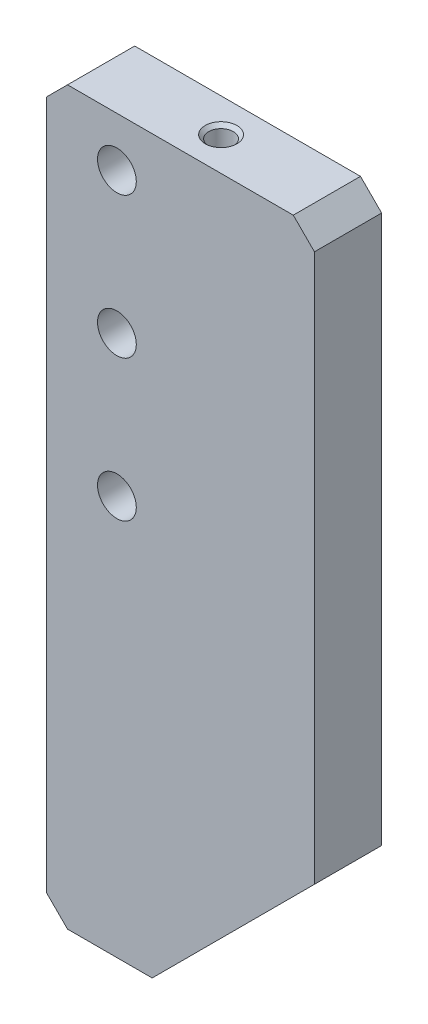
ISO-10303-21;
HEADER;
FILE_DESCRIPTION(('STEP AP214'),'2;1');
FILE_NAME('part.step','',(''),(''),'','','');
FILE_SCHEMA(('AUTOMOTIVE_DESIGN { 1 0 10303 214 1 1 1 1 }'));
ENDSEC;
DATA;
#1=APPLICATION_CONTEXT('core data for automotive mechanical design processes');
#2=APPLICATION_PROTOCOL_DEFINITION('international standard','automotive_design',2000,#1);
#3=PRODUCT_CONTEXT('',#1,'mechanical');
#4=PRODUCT('Part','Part','',(#3));
#5=PRODUCT_RELATED_PRODUCT_CATEGORY('part','',(#4));
#6=PRODUCT_DEFINITION_FORMATION('','',#4);
#7=PRODUCT_DEFINITION_CONTEXT('part definition',#1,'design');
#8=PRODUCT_DEFINITION('design','',#6,#7);
#9=PRODUCT_DEFINITION_SHAPE('','',#8);
#10=(LENGTH_UNIT() NAMED_UNIT(*) SI_UNIT(.MILLI.,.METRE.));
#11=(NAMED_UNIT(*) PLANE_ANGLE_UNIT() SI_UNIT($,.RADIAN.));
#12=(NAMED_UNIT(*) SI_UNIT($,.STERADIAN.) SOLID_ANGLE_UNIT());
#13=UNCERTAINTY_MEASURE_WITH_UNIT(LENGTH_MEASURE(1.E-05),#10,'distance_accuracy_value','');
#14=(GEOMETRIC_REPRESENTATION_CONTEXT(3) GLOBAL_UNCERTAINTY_ASSIGNED_CONTEXT((#13)) GLOBAL_UNIT_ASSIGNED_CONTEXT((#10,
#11,#12)) REPRESENTATION_CONTEXT('',''));
#15=CARTESIAN_POINT('',(0.,0.,0.));
#16=DIRECTION('',(0.,0.,1.));
#17=DIRECTION('',(1.,0.,0.));
#18=AXIS2_PLACEMENT_3D('',#15,#16,#17);
#19=CARTESIAN_POINT('',(-147.247691321001,32.5523086789982,-4.7625));
#20=DIRECTION('',(0.707106781186572,-0.707106781186523,0.));
#21=DIRECTION('',(0.707106781186523,0.707106781186572,0.));
#22=AXIS2_PLACEMENT_3D('',#19,#20,#21);
#23=PLANE('',#22);
#24=DIRECTION('',(0.,0.,1.));
#25=VECTOR('',#24,1.);
#26=CARTESIAN_POINT('',(-147.247691321001,32.5523086789982,-4.7625));
#27=LINE('',#26,#25);
#28=CARTESIAN_POINT('',(-147.247691321001,32.5523086789982,-4.7625));
#29=VERTEX_POINT('',#28);
#30=CARTESIAN_POINT('',(-147.247691321001,32.5523086789982,4.7625));
#31=VERTEX_POINT('',#30);
#32=EDGE_CURVE('E161',#29,#31,#27,.T.);
#33=ORIENTED_EDGE('',*,*,#32,.T.);
#34=DIRECTION('',(0.707106781186523,0.707106781186572,0.));
#35=VECTOR('',#34,1.);
#36=CARTESIAN_POINT('',(-147.247691321001,32.5523086789982,4.7625));
#37=LINE('',#36,#35);
#38=CARTESIAN_POINT('',(-170.247691321001,9.55230867899661,4.7625));
#39=VERTEX_POINT('',#38);
#40=EDGE_CURVE('E125',#39,#31,#37,.T.);
#41=ORIENTED_EDGE('',*,*,#40,.F.);
#42=DIRECTION('',(0.,0.,1.));
#43=VECTOR('',#42,1.);
#44=CARTESIAN_POINT('',(-170.247691321001,9.55230867899661,-4.7625));
#45=LINE('',#44,#43);
#46=CARTESIAN_POINT('',(-170.247691321001,9.55230867899661,-4.7625));
#47=VERTEX_POINT('',#46);
#48=EDGE_CURVE('E162',#47,#39,#45,.T.);
#49=ORIENTED_EDGE('',*,*,#48,.F.);
#50=DIRECTION('',(0.707106781186523,0.707106781186572,0.));
#51=VECTOR('',#50,1.);
#52=CARTESIAN_POINT('',(-147.247691321001,32.5523086789982,-4.7625));
#53=LINE('',#52,#51);
#54=EDGE_CURVE('E148',#47,#29,#53,.T.);
#55=ORIENTED_EDGE('',*,*,#54,.T.);
#56=EDGE_LOOP('',(#33,#41,#49,#55));
#57=FACE_BOUND('',#56,.T.);
#58=ADVANCED_FACE('F31',(#57),#23,.T.);
#59=CARTESIAN_POINT('',(-170.247691321001,9.55230867899661,-4.7625));
#60=DIRECTION('',(0.,-1.,0.));
#61=DIRECTION('',(1.,0.,0.));
#62=AXIS2_PLACEMENT_3D('',#59,#60,#61);
#63=PLANE('',#62);
#64=DIRECTION('',(1.,0.,0.));
#65=VECTOR('',#64,1.);
#66=CARTESIAN_POINT('',(-170.247691321001,9.55230867899661,4.7625));
#67=LINE('',#66,#65);
#68=CARTESIAN_POINT('',(-182.247691321001,9.55230867899657,4.7625));
#69=VERTEX_POINT('',#68);
#70=EDGE_CURVE('E137',#69,#39,#67,.T.);
#71=ORIENTED_EDGE('',*,*,#70,.F.);
#72=DIRECTION('',(0.,0.,-1.));
#73=VECTOR('',#72,1.);
#74=CARTESIAN_POINT('',(-182.247691321001,9.55230867899657,-4.7625));
#75=LINE('',#74,#73);
#76=CARTESIAN_POINT('',(-182.247691321001,9.55230867899657,-4.7625));
#77=VERTEX_POINT('',#76);
#78=EDGE_CURVE('E189',#69,#77,#75,.T.);
#79=ORIENTED_EDGE('',*,*,#78,.T.);
#80=DIRECTION('',(1.,0.,0.));
#81=VECTOR('',#80,1.);
#82=CARTESIAN_POINT('',(-170.247691321001,9.55230867899661,-4.7625));
#83=LINE('',#82,#81);
#84=EDGE_CURVE('E159',#77,#47,#83,.T.);
#85=ORIENTED_EDGE('',*,*,#84,.T.);
#86=ORIENTED_EDGE('',*,*,#48,.T.);
#87=EDGE_LOOP('',(#71,#79,#85,#86));
#88=FACE_BOUND('',#87,.T.);
#89=ADVANCED_FACE('F206',(#88),#63,.T.);
#90=CARTESIAN_POINT('',(-185.247691321001,113.192388155427,-4.7625));
#91=DIRECTION('',(-1.,0.,0.));
#92=DIRECTION('',(0.,-1.,0.));
#93=AXIS2_PLACEMENT_3D('',#90,#91,#92);
#94=PLANE('',#93);
#95=DIRECTION('',(0.,-1.,0.));
#96=VECTOR('',#95,1.);
#97=CARTESIAN_POINT('',(-185.247691321001,113.192388155427,-4.7625));
#98=LINE('',#97,#96);
#99=CARTESIAN_POINT('',(-185.247691321001,110.192388155427,-4.7625));
#100=VERTEX_POINT('',#99);
#101=CARTESIAN_POINT('',(-185.247691321001,12.5523086789966,-4.7625));
#102=VERTEX_POINT('',#101);
#103=EDGE_CURVE('E157',#100,#102,#98,.T.);
#104=ORIENTED_EDGE('',*,*,#103,.T.);
#105=DIRECTION('',(0.,0.,1.));
#106=VECTOR('',#105,1.);
#107=CARTESIAN_POINT('',(-185.247691321001,12.5523086789966,-4.7625));
#108=LINE('',#107,#106);
#109=CARTESIAN_POINT('',(-185.247691321001,12.5523086789966,4.7625));
#110=VERTEX_POINT('',#109);
#111=EDGE_CURVE('E186',#102,#110,#108,.T.);
#112=ORIENTED_EDGE('',*,*,#111,.T.);
#113=DIRECTION('',(0.,-1.,0.));
#114=VECTOR('',#113,1.);
#115=CARTESIAN_POINT('',(-185.247691321001,113.192388155427,4.7625));
#116=LINE('',#115,#114);
#117=CARTESIAN_POINT('',(-185.247691321001,110.192388155427,4.7625));
#118=VERTEX_POINT('',#117);
#119=EDGE_CURVE('E134',#118,#110,#116,.T.);
#120=ORIENTED_EDGE('',*,*,#119,.F.);
#121=DIRECTION('',(0.,0.,-1.));
#122=VECTOR('',#121,1.);
#123=CARTESIAN_POINT('',(-185.247691321001,110.192388155427,-4.7625));
#124=LINE('',#123,#122);
#125=EDGE_CURVE('E53',#118,#100,#124,.T.);
#126=ORIENTED_EDGE('',*,*,#125,.T.);
#127=EDGE_LOOP('',(#104,#112,#120,#126));
#128=FACE_BOUND('',#127,.T.);
#129=ADVANCED_FACE('F212',(#128),#94,.T.);
#130=CARTESIAN_POINT('',(-185.247691321001,113.192388155427,-4.7625));
#131=DIRECTION('',(0.,1.,0.));
#132=DIRECTION('',(-1.,0.,0.));
#133=AXIS2_PLACEMENT_3D('',#130,#131,#132);
#134=PLANE('',#133);
#135=CARTESIAN_POINT('',(-165.247691321001,113.192388155427,0.));
#136=DIRECTION('',(0.,1.,0.));
#137=DIRECTION('',(-1.,0.,0.));
#138=AXIS2_PLACEMENT_3D('',#135,#136,#137);
#139=CIRCLE('',#138,2.25);
#140=CARTESIAN_POINT('',(-167.497691321001,113.192388155427,0.));
#141=VERTEX_POINT('',#140);
#142=EDGE_CURVE('E11',#141,#141,#139,.F.);
#143=ORIENTED_EDGE('',*,*,#142,.T.);
#144=EDGE_LOOP('',(#143));
#145=FACE_BOUND('',#144,.T.);
#146=DIRECTION('',(-1.,0.,0.));
#147=VECTOR('',#146,1.);
#148=CARTESIAN_POINT('',(-185.247691321001,113.192388155427,4.7625));
#149=LINE('',#148,#147);
#150=CARTESIAN_POINT('',(-150.247691321001,113.192388155427,4.7625));
#151=VERTEX_POINT('',#150);
#152=CARTESIAN_POINT('',(-182.247691321001,113.192388155427,4.7625));
#153=VERTEX_POINT('',#152);
#154=EDGE_CURVE('E131',#151,#153,#149,.T.);
#155=ORIENTED_EDGE('',*,*,#154,.F.);
#156=DIRECTION('',(0.,0.,-1.));
#157=VECTOR('',#156,1.);
#158=CARTESIAN_POINT('',(-150.247691321001,113.192388155427,-4.7625));
#159=LINE('',#158,#157);
#160=CARTESIAN_POINT('',(-150.247691321001,113.192388155427,-4.7625));
#161=VERTEX_POINT('',#160);
#162=EDGE_CURVE('E178',#151,#161,#159,.T.);
#163=ORIENTED_EDGE('',*,*,#162,.T.);
#164=DIRECTION('',(-1.,0.,0.));
#165=VECTOR('',#164,1.);
#166=CARTESIAN_POINT('',(-185.247691321001,113.192388155427,-4.7625));
#167=LINE('',#166,#165);
#168=CARTESIAN_POINT('',(-182.247691321001,113.192388155427,-4.7625));
#169=VERTEX_POINT('',#168);
#170=EDGE_CURVE('E154',#161,#169,#167,.T.);
#171=ORIENTED_EDGE('',*,*,#170,.T.);
#172=DIRECTION('',(0.,0.,1.));
#173=VECTOR('',#172,1.);
#174=CARTESIAN_POINT('',(-182.247691321001,113.192388155427,-4.7625));
#175=LINE('',#174,#173);
#176=EDGE_CURVE('E175',#169,#153,#175,.T.);
#177=ORIENTED_EDGE('',*,*,#176,.T.);
#178=EDGE_LOOP('',(#155,#163,#171,#177));
#179=FACE_BOUND('',#178,.T.);
#180=ADVANCED_FACE('F236',(#145,#179),#134,.T.);
#181=CARTESIAN_POINT('',(-147.247691321001,113.192388155427,-4.7625));
#182=DIRECTION('',(1.,0.,0.));
#183=DIRECTION('',(0.,1.,0.));
#184=AXIS2_PLACEMENT_3D('',#181,#182,#183);
#185=PLANE('',#184);
#186=DIRECTION('',(0.,1.,0.));
#187=VECTOR('',#186,1.);
#188=CARTESIAN_POINT('',(-147.247691321001,113.192388155427,-4.7625));
#189=LINE('',#188,#187);
#190=CARTESIAN_POINT('',(-147.247691321001,110.192388155427,-4.7625));
#191=VERTEX_POINT('',#190);
#192=EDGE_CURVE('E151',#29,#191,#189,.T.);
#193=ORIENTED_EDGE('',*,*,#192,.T.);
#194=DIRECTION('',(0.,0.,1.));
#195=VECTOR('',#194,1.);
#196=CARTESIAN_POINT('',(-147.247691321001,110.192388155427,-4.7625));
#197=LINE('',#196,#195);
#198=CARTESIAN_POINT('',(-147.247691321001,110.192388155427,4.7625));
#199=VERTEX_POINT('',#198);
#200=EDGE_CURVE('E165',#191,#199,#197,.T.);
#201=ORIENTED_EDGE('',*,*,#200,.T.);
#202=DIRECTION('',(0.,1.,0.));
#203=VECTOR('',#202,1.);
#204=CARTESIAN_POINT('',(-147.247691321001,113.192388155427,4.7625));
#205=LINE('',#204,#203);
#206=EDGE_CURVE('E128',#31,#199,#205,.T.);
#207=ORIENTED_EDGE('',*,*,#206,.F.);
#208=ORIENTED_EDGE('',*,*,#32,.F.);
#209=EDGE_LOOP('',(#193,#201,#207,#208));
#210=FACE_BOUND('',#209,.T.);
#211=ADVANCED_FACE('F217',(#210),#185,.T.);
#212=CARTESIAN_POINT('',(-170.247691321001,9.55230867899661,-4.7625));
#213=DIRECTION('',(0.,0.,-1.));
#214=DIRECTION('',(-1.,0.,0.));
#215=AXIS2_PLACEMENT_3D('',#212,#213,#214);
#216=PLANE('',#215);
#217=CARTESIAN_POINT('',(-175.247691321001,106.192388155427,-4.7625));
#218=DIRECTION('',(0.,0.,1.));
#219=DIRECTION('',(1.,0.,0.));
#220=AXIS2_PLACEMENT_3D('',#217,#218,#219);
#221=CIRCLE('',#220,2.75000000000001);
#222=CARTESIAN_POINT('',(-172.497691321001,106.192388155427,-4.7625));
#223=VERTEX_POINT('',#222);
#224=EDGE_CURVE('E139',#223,#223,#221,.T.);
#225=ORIENTED_EDGE('',*,*,#224,.T.);
#226=EDGE_LOOP('',(#225));
#227=FACE_BOUND('',#226,.T.);
#228=CARTESIAN_POINT('',(-175.247691321001,86.1923881554272,-4.7625));
#229=DIRECTION('',(0.,0.,1.));
#230=DIRECTION('',(1.,0.,0.));
#231=AXIS2_PLACEMENT_3D('',#228,#229,#230);
#232=CIRCLE('',#231,2.75000000000001);
#233=CARTESIAN_POINT('',(-172.497691321001,86.1923881554272,-4.7625));
#234=VERTEX_POINT('',#233);
#235=EDGE_CURVE('E142',#234,#234,#232,.T.);
#236=ORIENTED_EDGE('',*,*,#235,.T.);
#237=EDGE_LOOP('',(#236));
#238=FACE_BOUND('',#237,.T.);
#239=CARTESIAN_POINT('',(-175.247691321001,66.1923881554272,-4.7625));
#240=DIRECTION('',(0.,0.,1.));
#241=DIRECTION('',(1.,0.,0.));
#242=AXIS2_PLACEMENT_3D('',#239,#240,#241);
#243=CIRCLE('',#242,2.75000000000001);
#244=CARTESIAN_POINT('',(-172.497691321001,66.1923881554272,-4.7625));
#245=VERTEX_POINT('',#244);
#246=EDGE_CURVE('E145',#245,#245,#243,.T.);
#247=ORIENTED_EDGE('',*,*,#246,.T.);
#248=EDGE_LOOP('',(#247));
#249=FACE_BOUND('',#248,.T.);
#250=ORIENTED_EDGE('',*,*,#170,.F.);
#251=DIRECTION('',(-0.707106781186551,0.707106781186544,0.));
#252=VECTOR('',#251,1.);
#253=CARTESIAN_POINT('',(-108.427651582786,71.3723484172124,-4.7625));
#254=LINE('',#253,#252);
#255=EDGE_CURVE('E183',#161,#191,#254,.F.);
#256=ORIENTED_EDGE('',*,*,#255,.T.);
#257=ORIENTED_EDGE('',*,*,#192,.F.);
#258=ORIENTED_EDGE('',*,*,#54,.F.);
#259=ORIENTED_EDGE('',*,*,#84,.F.);
#260=DIRECTION('',(0.707106781186551,-0.707106781186544,0.));
#261=VECTOR('',#260,1.);
#262=CARTESIAN_POINT('',(-176.247691321001,3.5523086789966,-4.7625));
#263=LINE('',#262,#261);
#264=EDGE_CURVE('E46',#77,#102,#263,.F.);
#265=ORIENTED_EDGE('',*,*,#264,.T.);
#266=ORIENTED_EDGE('',*,*,#103,.F.);
#267=DIRECTION('',(-0.707106781186549,-0.707106781186546,0.));
#268=VECTOR('',#267,1.);
#269=CARTESIAN_POINT('',(-228.067731059216,67.3723484172121,-4.7625));
#270=LINE('',#269,#268);
#271=EDGE_CURVE('E180',#100,#169,#270,.F.);
#272=ORIENTED_EDGE('',*,*,#271,.T.);
#273=EDGE_LOOP('',(#250,#256,#257,#258,#259,#265,#266,#272));
#274=FACE_BOUND('',#273,.T.);
#275=ADVANCED_FACE('F240',(#227,#238,#249,#274),#216,.T.);
#276=CARTESIAN_POINT('',(-175.247691321001,66.1923881554272,-4.7625));
#277=DIRECTION('',(0.,0.,1.));
#278=DIRECTION('',(1.,0.,0.));
#279=AXIS2_PLACEMENT_3D('',#276,#277,#278);
#280=CYLINDRICAL_SURFACE('',#279,2.75000000000001);
#281=ORIENTED_EDGE('',*,*,#246,.F.);
#282=EDGE_LOOP('',(#281));
#283=FACE_BOUND('',#282,.T.);
#284=CARTESIAN_POINT('',(-175.247691321001,66.1923881554272,4.7625));
#285=DIRECTION('',(0.,0.,1.));
#286=DIRECTION('',(1.,0.,0.));
#287=AXIS2_PLACEMENT_3D('',#284,#285,#286);
#288=CIRCLE('',#287,2.75000000000001);
#289=CARTESIAN_POINT('',(-172.497691321001,66.1923881554272,4.7625));
#290=VERTEX_POINT('',#289);
#291=EDGE_CURVE('E122',#290,#290,#288,.T.);
#292=ORIENTED_EDGE('',*,*,#291,.T.);
#293=EDGE_LOOP('',(#292));
#294=FACE_BOUND('',#293,.T.);
#295=ADVANCED_FACE('F253',(#283,#294),#280,.F.);
#296=CARTESIAN_POINT('',(-175.247691321001,86.1923881554272,-4.7625));
#297=DIRECTION('',(0.,0.,1.));
#298=DIRECTION('',(1.,0.,0.));
#299=AXIS2_PLACEMENT_3D('',#296,#297,#298);
#300=CYLINDRICAL_SURFACE('',#299,2.75000000000001);
#301=ORIENTED_EDGE('',*,*,#235,.F.);
#302=EDGE_LOOP('',(#301));
#303=FACE_BOUND('',#302,.T.);
#304=CARTESIAN_POINT('',(-175.247691321001,86.1923881554272,4.7625));
#305=DIRECTION('',(0.,0.,1.));
#306=DIRECTION('',(1.,0.,0.));
#307=AXIS2_PLACEMENT_3D('',#304,#305,#306);
#308=CIRCLE('',#307,2.75000000000001);
#309=CARTESIAN_POINT('',(-172.497691321001,86.1923881554272,4.7625));
#310=VERTEX_POINT('',#309);
#311=EDGE_CURVE('E113',#310,#310,#308,.T.);
#312=ORIENTED_EDGE('',*,*,#311,.T.);
#313=EDGE_LOOP('',(#312));
#314=FACE_BOUND('',#313,.T.);
#315=ADVANCED_FACE('F264',(#303,#314),#300,.F.);
#316=CARTESIAN_POINT('',(-175.247691321001,106.192388155427,-4.7625));
#317=DIRECTION('',(0.,0.,1.));
#318=DIRECTION('',(1.,0.,0.));
#319=AXIS2_PLACEMENT_3D('',#316,#317,#318);
#320=CYLINDRICAL_SURFACE('',#319,2.75000000000001);
#321=ORIENTED_EDGE('',*,*,#224,.F.);
#322=EDGE_LOOP('',(#321));
#323=FACE_BOUND('',#322,.T.);
#324=CARTESIAN_POINT('',(-175.247691321001,106.192388155427,4.7625));
#325=DIRECTION('',(0.,0.,1.));
#326=DIRECTION('',(1.,0.,0.));
#327=AXIS2_PLACEMENT_3D('',#324,#325,#326);
#328=CIRCLE('',#327,2.75000000000001);
#329=CARTESIAN_POINT('',(-172.497691321001,106.192388155427,4.7625));
#330=VERTEX_POINT('',#329);
#331=EDGE_CURVE('E109',#330,#330,#328,.T.);
#332=ORIENTED_EDGE('',*,*,#331,.T.);
#333=EDGE_LOOP('',(#332));
#334=FACE_BOUND('',#333,.T.);
#335=ADVANCED_FACE('F268',(#323,#334),#320,.F.);
#336=CARTESIAN_POINT('',(-170.247691321001,9.55230867899661,4.7625));
#337=DIRECTION('',(0.,0.,-1.));
#338=DIRECTION('',(-1.,0.,0.));
#339=AXIS2_PLACEMENT_3D('',#336,#337,#338);
#340=PLANE('',#339);
#341=ORIENTED_EDGE('',*,*,#311,.F.);
#342=EDGE_LOOP('',(#341));
#343=FACE_BOUND('',#342,.T.);
#344=ORIENTED_EDGE('',*,*,#206,.T.);
#345=DIRECTION('',(0.707106781186551,-0.707106781186544,0.));
#346=VECTOR('',#345,1.);
#347=CARTESIAN_POINT('',(-147.247691321001,110.192388155427,4.7625));
#348=LINE('',#347,#346);
#349=EDGE_CURVE('E173',#199,#151,#348,.F.);
#350=ORIENTED_EDGE('',*,*,#349,.T.);
#351=ORIENTED_EDGE('',*,*,#154,.T.);
#352=DIRECTION('',(0.707106781186549,0.707106781186546,0.));
#353=VECTOR('',#352,1.);
#354=CARTESIAN_POINT('',(-182.247691321001,113.192388155427,4.7625));
#355=LINE('',#354,#353);
#356=EDGE_CURVE('E169',#153,#118,#355,.F.);
#357=ORIENTED_EDGE('',*,*,#356,.T.);
#358=ORIENTED_EDGE('',*,*,#119,.T.);
#359=DIRECTION('',(-0.707106781186551,0.707106781186544,0.));
#360=VECTOR('',#359,1.);
#361=CARTESIAN_POINT('',(-185.247691321001,12.5523086789966,4.7625));
#362=LINE('',#361,#360);
#363=EDGE_CURVE('E171',#110,#69,#362,.F.);
#364=ORIENTED_EDGE('',*,*,#363,.T.);
#365=ORIENTED_EDGE('',*,*,#70,.T.);
#366=ORIENTED_EDGE('',*,*,#40,.T.);
#367=EDGE_LOOP('',(#344,#350,#351,#357,#358,#364,#365,#366));
#368=FACE_BOUND('',#367,.T.);
#369=ORIENTED_EDGE('',*,*,#291,.F.);
#370=EDGE_LOOP('',(#369));
#371=FACE_BOUND('',#370,.T.);
#372=ORIENTED_EDGE('',*,*,#331,.F.);
#373=EDGE_LOOP('',(#372));
#374=FACE_BOUND('',#373,.T.);
#375=ADVANCED_FACE('F103',(#343,#368,#371,#374),#340,.F.);
#376=CARTESIAN_POINT('',(-165.247691321001,93.0191830746703,0.));
#377=DIRECTION('',(0.,1.,0.));
#378=DIRECTION('',(-1.,0.,0.));
#379=AXIS2_PLACEMENT_3D('',#376,#377,#378);
#380=CONICAL_SURFACE('',#379,1.20000000000003,1.0471975511966);
#381=CARTESIAN_POINT('',(-165.247691321001,92.3263627516427,0.));
#382=VERTEX_POINT('',#381);
#383=VERTEX_LOOP('',#382);
#384=FACE_BOUND('',#383,.T.);
#385=CARTESIAN_POINT('',(-165.247691321001,93.0191830746703,0.));
#386=DIRECTION('',(0.,1.,0.));
#387=DIRECTION('',(-1.,0.,0.));
#388=AXIS2_PLACEMENT_3D('',#385,#386,#387);
#389=CIRCLE('',#388,1.20000000000004);
#390=CARTESIAN_POINT('',(-166.447691321001,93.0191830746703,0.));
#391=VERTEX_POINT('',#390);
#392=EDGE_CURVE('E107',#391,#391,#389,.T.);
#393=ORIENTED_EDGE('',*,*,#392,.T.);
#394=EDGE_LOOP('',(#393));
#395=FACE_BOUND('',#394,.T.);
#396=ADVANCED_FACE('F99',(#384,#395),#380,.F.);
#397=CARTESIAN_POINT('',(-165.247691321001,113.192388155427,0.));
#398=DIRECTION('',(0.,1.,0.));
#399=DIRECTION('',(-1.,0.,0.));
#400=AXIS2_PLACEMENT_3D('',#397,#398,#399);
#401=CYLINDRICAL_SURFACE('',#400,1.20000000000002);
#402=ORIENTED_EDGE('',*,*,#392,.F.);
#403=EDGE_LOOP('',(#402));
#404=FACE_BOUND('',#403,.T.);
#405=CARTESIAN_POINT('',(-165.247691321001,107.874845507373,0.));
#406=DIRECTION('',(0.,1.,0.));
#407=DIRECTION('',(-1.,0.,0.));
#408=AXIS2_PLACEMENT_3D('',#405,#406,#407);
#409=CIRCLE('',#408,1.20000000000001);
#410=CARTESIAN_POINT('',(-166.447691321001,107.874845507373,0.));
#411=VERTEX_POINT('',#410);
#412=EDGE_CURVE('E110',#411,#411,#409,.T.);
#413=ORIENTED_EDGE('',*,*,#412,.T.);
#414=EDGE_LOOP('',(#413));
#415=FACE_BOUND('',#414,.T.);
#416=ADVANCED_FACE('F102',(#404,#415),#401,.F.);
#417=CARTESIAN_POINT('',(-165.247691321001,108.192388155427,0.));
#418=DIRECTION('',(0.,1.,0.));
#419=DIRECTION('',(-1.,0.,0.));
#420=AXIS2_PLACEMENT_3D('',#417,#418,#419);
#421=CONICAL_SURFACE('',#420,1.75,1.04719755119659);
#422=ORIENTED_EDGE('',*,*,#412,.F.);
#423=EDGE_LOOP('',(#422));
#424=FACE_BOUND('',#423,.T.);
#425=CARTESIAN_POINT('',(-165.247691321001,108.192388155427,0.));
#426=DIRECTION('',(0.,1.,0.));
#427=DIRECTION('',(-1.,0.,0.));
#428=AXIS2_PLACEMENT_3D('',#425,#426,#427);
#429=CIRCLE('',#428,1.75000000000001);
#430=CARTESIAN_POINT('',(-166.997691321001,108.192388155427,0.));
#431=VERTEX_POINT('',#430);
#432=EDGE_CURVE('E116',#431,#431,#429,.T.);
#433=ORIENTED_EDGE('',*,*,#432,.T.);
#434=EDGE_LOOP('',(#433));
#435=FACE_BOUND('',#434,.T.);
#436=ADVANCED_FACE('F278',(#424,#435),#421,.F.);
#437=CARTESIAN_POINT('',(-165.247691321001,113.192388155427,0.));
#438=DIRECTION('',(0.,1.,0.));
#439=DIRECTION('',(-1.,0.,0.));
#440=AXIS2_PLACEMENT_3D('',#437,#438,#439);
#441=CYLINDRICAL_SURFACE('',#440,1.75);
#442=CARTESIAN_POINT('',(-165.247691321001,112.692388155427,0.));
#443=DIRECTION('',(0.,1.,0.));
#444=DIRECTION('',(0.,0.,1.));
#445=AXIS2_PLACEMENT_3D('',#442,#443,#444);
#446=CIRCLE('',#445,1.75);
#447=CARTESIAN_POINT('',(-165.247691321001,112.692388155427,1.75));
#448=VERTEX_POINT('',#447);
#449=EDGE_CURVE('E39',#448,#448,#446,.T.);
#450=ORIENTED_EDGE('',*,*,#449,.T.);
#451=EDGE_LOOP('',(#450));
#452=FACE_BOUND('',#451,.T.);
#453=ORIENTED_EDGE('',*,*,#432,.F.);
#454=EDGE_LOOP('',(#453));
#455=FACE_BOUND('',#454,.T.);
#456=ADVANCED_FACE('F193',(#452,#455),#441,.F.);
#457=CARTESIAN_POINT('',(-147.247691321001,110.192388155427,-4.7625));
#458=DIRECTION('',(-0.707106781186544,-0.707106781186551,0.));
#459=DIRECTION('',(0.707106781186551,-0.707106781186544,0.));
#460=AXIS2_PLACEMENT_3D('',#457,#458,#459);
#461=PLANE('',#460);
#462=ORIENTED_EDGE('',*,*,#255,.F.);
#463=ORIENTED_EDGE('',*,*,#162,.F.);
#464=ORIENTED_EDGE('',*,*,#349,.F.);
#465=ORIENTED_EDGE('',*,*,#200,.F.);
#466=EDGE_LOOP('',(#462,#463,#464,#465));
#467=FACE_BOUND('',#466,.T.);
#468=ADVANCED_FACE('F219',(#467),#461,.F.);
#469=CARTESIAN_POINT('',(-185.247691321001,12.5523086789966,-4.7625));
#470=DIRECTION('',(0.707106781186544,0.707106781186551,0.));
#471=DIRECTION('',(-0.707106781186551,0.707106781186544,0.));
#472=AXIS2_PLACEMENT_3D('',#469,#470,#471);
#473=PLANE('',#472);
#474=ORIENTED_EDGE('',*,*,#264,.F.);
#475=ORIENTED_EDGE('',*,*,#78,.F.);
#476=ORIENTED_EDGE('',*,*,#363,.F.);
#477=ORIENTED_EDGE('',*,*,#111,.F.);
#478=EDGE_LOOP('',(#474,#475,#476,#477));
#479=FACE_BOUND('',#478,.T.);
#480=ADVANCED_FACE('F202',(#479),#473,.F.);
#481=CARTESIAN_POINT('',(-182.247691321001,113.192388155427,-4.7625));
#482=DIRECTION('',(0.707106781186546,-0.707106781186549,0.));
#483=DIRECTION('',(0.707106781186549,0.707106781186546,0.));
#484=AXIS2_PLACEMENT_3D('',#481,#482,#483);
#485=PLANE('',#484);
#486=ORIENTED_EDGE('',*,*,#271,.F.);
#487=ORIENTED_EDGE('',*,*,#125,.F.);
#488=ORIENTED_EDGE('',*,*,#356,.F.);
#489=ORIENTED_EDGE('',*,*,#176,.F.);
#490=EDGE_LOOP('',(#486,#487,#488,#489));
#491=FACE_BOUND('',#490,.T.);
#492=ADVANCED_FACE('F197',(#491),#485,.F.);
#493=CARTESIAN_POINT('',(-165.247691321001,112.692388155427,0.));
#494=DIRECTION('',(0.,1.,0.));
#495=DIRECTION('',(0.,0.,1.));
#496=AXIS2_PLACEMENT_3D('',#493,#494,#495);
#497=CONICAL_SURFACE('',#496,1.75,0.785398163397448);
#498=ORIENTED_EDGE('',*,*,#142,.F.);
#499=EDGE_LOOP('',(#498));
#500=FACE_BOUND('',#499,.T.);
#501=ORIENTED_EDGE('',*,*,#449,.F.);
#502=EDGE_LOOP('',(#501));
#503=FACE_BOUND('',#502,.T.);
#504=ADVANCED_FACE('F33',(#500,#503),#497,.F.);
#505=CLOSED_SHELL('',(#58,#89,#129,#180,#211,#275,#295,#315,#335,#375,#396,#416,#436,#456,#468,
#480,#492,#504));
#506=MANIFOLD_SOLID_BREP('B2',#505);
#507=ADVANCED_BREP_SHAPE_REPRESENTATION('',(#18,#506),#14);
#508=SHAPE_DEFINITION_REPRESENTATION(#9,#507);
ENDSEC;
END-ISO-10303-21;
